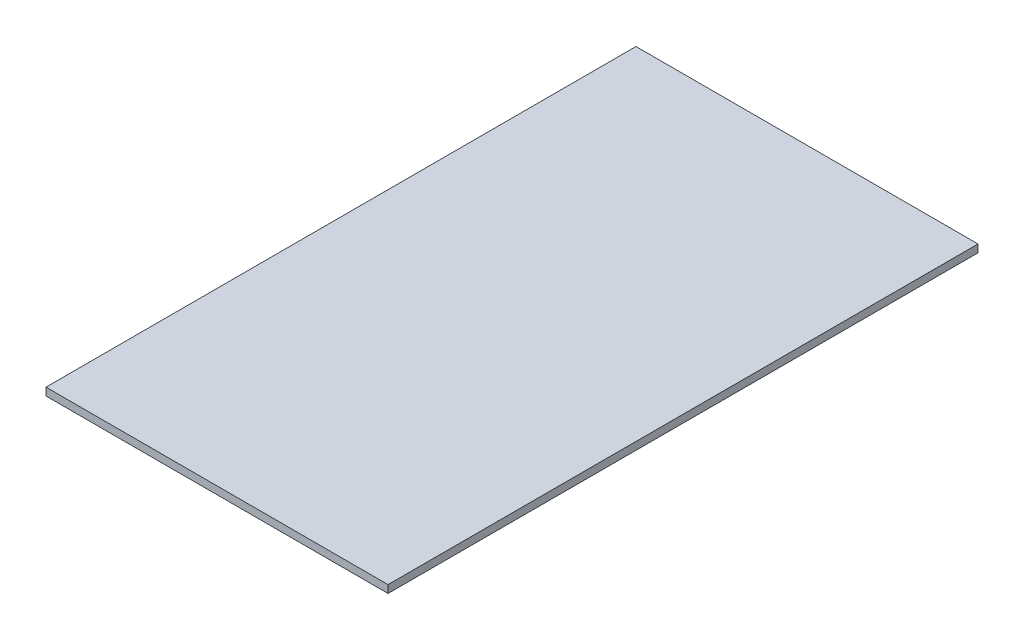
ISO-10303-21;
HEADER;
FILE_DESCRIPTION(('STEP AP214'),'2;1');
FILE_NAME('part.step','',(''),(''),'','','');
FILE_SCHEMA(('AUTOMOTIVE_DESIGN { 1 0 10303 214 1 1 1 1 }'));
ENDSEC;
DATA;
#1=APPLICATION_CONTEXT('core data for automotive mechanical design processes');
#2=APPLICATION_PROTOCOL_DEFINITION('international standard','automotive_design',2000,#1);
#3=PRODUCT_CONTEXT('',#1,'mechanical');
#4=PRODUCT('Part','Part','',(#3));
#5=PRODUCT_RELATED_PRODUCT_CATEGORY('part','',(#4));
#6=PRODUCT_DEFINITION_FORMATION('','',#4);
#7=PRODUCT_DEFINITION_CONTEXT('part definition',#1,'design');
#8=PRODUCT_DEFINITION('design','',#6,#7);
#9=PRODUCT_DEFINITION_SHAPE('','',#8);
#10=(LENGTH_UNIT() NAMED_UNIT(*) SI_UNIT(.MILLI.,.METRE.));
#11=(NAMED_UNIT(*) PLANE_ANGLE_UNIT() SI_UNIT($,.RADIAN.));
#12=(NAMED_UNIT(*) SI_UNIT($,.STERADIAN.) SOLID_ANGLE_UNIT());
#13=UNCERTAINTY_MEASURE_WITH_UNIT(LENGTH_MEASURE(1.E-05),#10,'distance_accuracy_value','');
#14=(GEOMETRIC_REPRESENTATION_CONTEXT(3) GLOBAL_UNCERTAINTY_ASSIGNED_CONTEXT((#13)) GLOBAL_UNIT_ASSIGNED_CONTEXT((#10,
#11,#12)) REPRESENTATION_CONTEXT('',''));
#15=CARTESIAN_POINT('',(0.,0.,0.));
#16=DIRECTION('',(0.,0.,1.));
#17=DIRECTION('',(1.,0.,0.));
#18=AXIS2_PLACEMENT_3D('',#15,#16,#17);
#19=CARTESIAN_POINT('',(0.,1.8,0.));
#20=DIRECTION('',(1.,0.,0.));
#21=DIRECTION('',(0.,0.,-1.));
#22=AXIS2_PLACEMENT_3D('',#19,#20,#21);
#23=PLANE('',#22);
#24=DIRECTION('',(0.,0.,1.));
#25=VECTOR('',#24,1.);
#26=CARTESIAN_POINT('',(0.,0.,0.));
#27=LINE('',#26,#25);
#28=CARTESIAN_POINT('',(0.,0.,-138.));
#29=VERTEX_POINT('',#28);
#30=CARTESIAN_POINT('',(0.,0.,0.));
#31=VERTEX_POINT('',#30);
#32=EDGE_CURVE('E98',#29,#31,#27,.T.);
#33=ORIENTED_EDGE('',*,*,#32,.T.);
#34=DIRECTION('',(0.,-1.,0.));
#35=VECTOR('',#34,1.);
#36=CARTESIAN_POINT('',(0.,1.8,0.));
#37=LINE('',#36,#35);
#38=CARTESIAN_POINT('',(0.,1.8,0.));
#39=VERTEX_POINT('',#38);
#40=EDGE_CURVE('E11',#39,#31,#37,.T.);
#41=ORIENTED_EDGE('',*,*,#40,.F.);
#42=DIRECTION('',(0.,0.,1.));
#43=VECTOR('',#42,1.);
#44=CARTESIAN_POINT('',(0.,1.8,0.));
#45=LINE('',#44,#43);
#46=CARTESIAN_POINT('',(0.,1.8,-138.));
#47=VERTEX_POINT('',#46);
#48=EDGE_CURVE('E86',#47,#39,#45,.T.);
#49=ORIENTED_EDGE('',*,*,#48,.F.);
#50=DIRECTION('',(0.,-1.,0.));
#51=VECTOR('',#50,1.);
#52=CARTESIAN_POINT('',(0.,1.8,-138.));
#53=LINE('',#52,#51);
#54=EDGE_CURVE('E94',#47,#29,#53,.T.);
#55=ORIENTED_EDGE('',*,*,#54,.T.);
#56=EDGE_LOOP('',(#33,#41,#49,#55));
#57=FACE_BOUND('',#56,.T.);
#58=ADVANCED_FACE('F35',(#57),#23,.F.);
#59=CARTESIAN_POINT('',(0.,1.8,0.));
#60=DIRECTION('',(0.,0.,-1.));
#61=DIRECTION('',(-1.,0.,0.));
#62=AXIS2_PLACEMENT_3D('',#59,#60,#61);
#63=PLANE('',#62);
#64=DIRECTION('',(1.,0.,0.));
#65=VECTOR('',#64,1.);
#66=CARTESIAN_POINT('',(0.,0.,0.));
#67=LINE('',#66,#65);
#68=CARTESIAN_POINT('',(80.,0.,0.));
#69=VERTEX_POINT('',#68);
#70=EDGE_CURVE('E90',#31,#69,#67,.T.);
#71=ORIENTED_EDGE('',*,*,#70,.T.);
#72=DIRECTION('',(0.,-1.,0.));
#73=VECTOR('',#72,1.);
#74=CARTESIAN_POINT('',(80.,1.8,0.));
#75=LINE('',#74,#73);
#76=CARTESIAN_POINT('',(80.,1.8,0.));
#77=VERTEX_POINT('',#76);
#78=EDGE_CURVE('E43',#77,#69,#75,.T.);
#79=ORIENTED_EDGE('',*,*,#78,.F.);
#80=DIRECTION('',(1.,0.,0.));
#81=VECTOR('',#80,1.);
#82=CARTESIAN_POINT('',(0.,1.8,0.));
#83=LINE('',#82,#81);
#84=EDGE_CURVE('E81',#39,#77,#83,.T.);
#85=ORIENTED_EDGE('',*,*,#84,.F.);
#86=ORIENTED_EDGE('',*,*,#40,.T.);
#87=EDGE_LOOP('',(#71,#79,#85,#86));
#88=FACE_BOUND('',#87,.T.);
#89=ADVANCED_FACE('F89',(#88),#63,.F.);
#90=CARTESIAN_POINT('',(80.,1.8,0.));
#91=DIRECTION('',(-1.,0.,0.));
#92=DIRECTION('',(0.,0.,1.));
#93=AXIS2_PLACEMENT_3D('',#90,#91,#92);
#94=PLANE('',#93);
#95=DIRECTION('',(0.,0.,-1.));
#96=VECTOR('',#95,1.);
#97=CARTESIAN_POINT('',(80.,0.,0.));
#98=LINE('',#97,#96);
#99=CARTESIAN_POINT('',(80.,0.,-138.));
#100=VERTEX_POINT('',#99);
#101=EDGE_CURVE('E68',#69,#100,#98,.T.);
#102=ORIENTED_EDGE('',*,*,#101,.T.);
#103=DIRECTION('',(0.,-1.,0.));
#104=VECTOR('',#103,1.);
#105=CARTESIAN_POINT('',(80.,1.8,-138.));
#106=LINE('',#105,#104);
#107=CARTESIAN_POINT('',(80.,1.8,-138.));
#108=VERTEX_POINT('',#107);
#109=EDGE_CURVE('E91',#108,#100,#106,.T.);
#110=ORIENTED_EDGE('',*,*,#109,.F.);
#111=DIRECTION('',(0.,0.,-1.));
#112=VECTOR('',#111,1.);
#113=CARTESIAN_POINT('',(80.,1.8,0.));
#114=LINE('',#113,#112);
#115=EDGE_CURVE('E84',#77,#108,#114,.T.);
#116=ORIENTED_EDGE('',*,*,#115,.F.);
#117=ORIENTED_EDGE('',*,*,#78,.T.);
#118=EDGE_LOOP('',(#102,#110,#116,#117));
#119=FACE_BOUND('',#118,.T.);
#120=ADVANCED_FACE('F92',(#119),#94,.F.);
#121=CARTESIAN_POINT('',(0.,1.8,-138.));
#122=DIRECTION('',(0.,0.,1.));
#123=DIRECTION('',(1.,0.,0.));
#124=AXIS2_PLACEMENT_3D('',#121,#122,#123);
#125=PLANE('',#124);
#126=DIRECTION('',(-1.,0.,0.));
#127=VECTOR('',#126,1.);
#128=CARTESIAN_POINT('',(0.,0.,-138.));
#129=LINE('',#128,#127);
#130=EDGE_CURVE('E74',#100,#29,#129,.T.);
#131=ORIENTED_EDGE('',*,*,#130,.T.);
#132=ORIENTED_EDGE('',*,*,#54,.F.);
#133=DIRECTION('',(-1.,0.,0.));
#134=VECTOR('',#133,1.);
#135=CARTESIAN_POINT('',(0.,1.8,-138.));
#136=LINE('',#135,#134);
#137=EDGE_CURVE('E51',#108,#47,#136,.T.);
#138=ORIENTED_EDGE('',*,*,#137,.F.);
#139=ORIENTED_EDGE('',*,*,#109,.T.);
#140=EDGE_LOOP('',(#131,#132,#138,#139));
#141=FACE_BOUND('',#140,.T.);
#142=ADVANCED_FACE('F105',(#141),#125,.F.);
#143=CARTESIAN_POINT('',(0.,1.8,-138.));
#144=DIRECTION('',(0.,-1.,0.));
#145=DIRECTION('',(0.,0.,-1.));
#146=AXIS2_PLACEMENT_3D('',#143,#144,#145);
#147=PLANE('',#146);
#148=ORIENTED_EDGE('',*,*,#48,.T.);
#149=ORIENTED_EDGE('',*,*,#84,.T.);
#150=ORIENTED_EDGE('',*,*,#115,.T.);
#151=ORIENTED_EDGE('',*,*,#137,.T.);
#152=EDGE_LOOP('',(#148,#149,#150,#151));
#153=FACE_BOUND('',#152,.T.);
#154=ADVANCED_FACE('F82',(#153),#147,.F.);
#155=CARTESIAN_POINT('',(0.,0.,-138.));
#156=DIRECTION('',(0.,-1.,0.));
#157=DIRECTION('',(0.,0.,-1.));
#158=AXIS2_PLACEMENT_3D('',#155,#156,#157);
#159=PLANE('',#158);
#160=ORIENTED_EDGE('',*,*,#32,.F.);
#161=ORIENTED_EDGE('',*,*,#130,.F.);
#162=ORIENTED_EDGE('',*,*,#101,.F.);
#163=ORIENTED_EDGE('',*,*,#70,.F.);
#164=EDGE_LOOP('',(#160,#161,#162,#163));
#165=FACE_BOUND('',#164,.T.);
#166=ADVANCED_FACE('F108',(#165),#159,.T.);
#167=CLOSED_SHELL('',(#58,#89,#120,#142,#154,#166));
#168=MANIFOLD_SOLID_BREP('B2',#167);
#169=ADVANCED_BREP_SHAPE_REPRESENTATION('',(#18,#168),#14);
#170=SHAPE_DEFINITION_REPRESENTATION(#9,#169);
ENDSEC;
END-ISO-10303-21;
